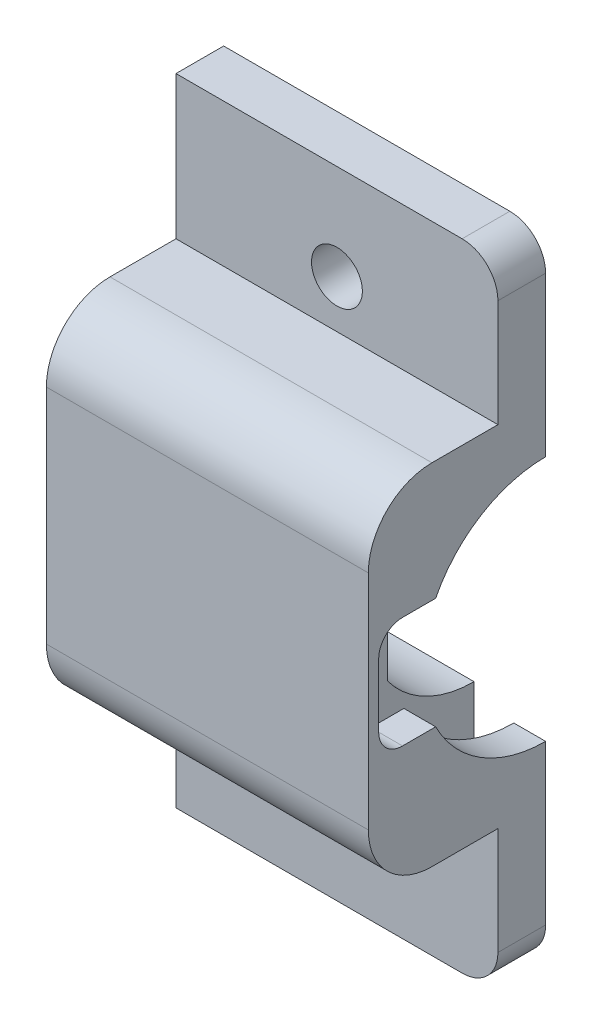
ISO-10303-21;
HEADER;
FILE_DESCRIPTION(('STEP AP214'),'2;1');
FILE_NAME('part.step','',(''),(''),'','','');
FILE_SCHEMA(('AUTOMOTIVE_DESIGN { 1 0 10303 214 1 1 1 1 }'));
ENDSEC;
DATA;
#1=APPLICATION_CONTEXT('core data for automotive mechanical design processes');
#2=APPLICATION_PROTOCOL_DEFINITION('international standard','automotive_design',2000,#1);
#3=PRODUCT_CONTEXT('',#1,'mechanical');
#4=PRODUCT('Part','Part','',(#3));
#5=PRODUCT_RELATED_PRODUCT_CATEGORY('part','',(#4));
#6=PRODUCT_DEFINITION_FORMATION('','',#4);
#7=PRODUCT_DEFINITION_CONTEXT('part definition',#1,'design');
#8=PRODUCT_DEFINITION('design','',#6,#7);
#9=PRODUCT_DEFINITION_SHAPE('','',#8);
#10=(LENGTH_UNIT() NAMED_UNIT(*) SI_UNIT(.MILLI.,.METRE.));
#11=(NAMED_UNIT(*) PLANE_ANGLE_UNIT() SI_UNIT($,.RADIAN.));
#12=(NAMED_UNIT(*) SI_UNIT($,.STERADIAN.) SOLID_ANGLE_UNIT());
#13=UNCERTAINTY_MEASURE_WITH_UNIT(LENGTH_MEASURE(1.E-05),#10,'distance_accuracy_value','');
#14=(GEOMETRIC_REPRESENTATION_CONTEXT(3) GLOBAL_UNCERTAINTY_ASSIGNED_CONTEXT((#13)) GLOBAL_UNIT_ASSIGNED_CONTEXT((#10,
#11,#12)) REPRESENTATION_CONTEXT('',''));
#15=CARTESIAN_POINT('',(0.,0.,0.));
#16=DIRECTION('',(0.,0.,1.));
#17=DIRECTION('',(1.,0.,0.));
#18=AXIS2_PLACEMENT_3D('',#15,#16,#17);
#19=CARTESIAN_POINT('',(1.75,0.,0.));
#20=DIRECTION('',(-1.,0.,0.));
#21=DIRECTION('',(0.,0.,1.));
#22=AXIS2_PLACEMENT_3D('',#19,#20,#21);
#23=PLANE('',#22);
#24=DIRECTION('',(0.,1.,0.));
#25=VECTOR('',#24,1.);
#26=CARTESIAN_POINT('',(1.75,23.982461550348,5.45));
#27=LINE('',#26,#25);
#28=CARTESIAN_POINT('',(1.75,16.017538449652,5.45));
#29=VERTEX_POINT('',#28);
#30=CARTESIAN_POINT('',(1.75,23.982461550348,5.45));
#31=VERTEX_POINT('',#30);
#32=EDGE_CURVE('E852',#29,#31,#27,.T.);
#33=ORIENTED_EDGE('',*,*,#32,.F.);
#34=CARTESIAN_POINT('',(1.75,20.,0.));
#35=DIRECTION('',(1.,0.,0.));
#36=DIRECTION('',(0.,0.,-1.));
#37=AXIS2_PLACEMENT_3D('',#34,#35,#36);
#38=CIRCLE('',#37,6.75);
#39=CARTESIAN_POINT('',(1.75,13.25,0.));
#40=VERTEX_POINT('',#39);
#41=EDGE_CURVE('E258',#29,#40,#38,.T.);
#42=ORIENTED_EDGE('',*,*,#41,.T.);
#43=DIRECTION('',(0.,1.,0.));
#44=VECTOR('',#43,1.);
#45=CARTESIAN_POINT('',(1.75,0.,0.));
#46=LINE('',#45,#44);
#47=CARTESIAN_POINT('',(1.75,26.75,0.));
#48=VERTEX_POINT('',#47);
#49=EDGE_CURVE('E406',#40,#48,#46,.T.);
#50=ORIENTED_EDGE('',*,*,#49,.T.);
#51=EDGE_CURVE('E267',#48,#31,#38,.T.);
#52=ORIENTED_EDGE('',*,*,#51,.T.);
#53=EDGE_LOOP('',(#33,#42,#50,#52));
#54=FACE_BOUND('',#53,.T.);
#55=ADVANCED_FACE('F35',(#54),#23,.F.);
#56=CARTESIAN_POINT('',(15.75,20.,0.));
#57=DIRECTION('',(1.,0.,0.));
#58=DIRECTION('',(0.,0.,-1.));
#59=AXIS2_PLACEMENT_3D('',#56,#57,#58);
#60=CYLINDRICAL_SURFACE('',#59,6.75);
#61=DIRECTION('',(-1.,0.,0.));
#62=VECTOR('',#61,1.);
#63=CARTESIAN_POINT('',(23.8203159789441,16.017538449652,5.45));
#64=LINE('',#63,#62);
#65=CARTESIAN_POINT('',(15.75,16.017538449652,5.45));
#66=VERTEX_POINT('',#65);
#67=EDGE_CURVE('E256',#66,#29,#64,.T.);
#68=ORIENTED_EDGE('',*,*,#67,.F.);
#69=CARTESIAN_POINT('',(15.75,20.,0.));
#70=DIRECTION('',(1.,0.,0.));
#71=DIRECTION('',(0.,0.,-1.));
#72=AXIS2_PLACEMENT_3D('',#69,#70,#71);
#73=CIRCLE('',#72,6.75);
#74=CARTESIAN_POINT('',(15.75,13.25,0.));
#75=VERTEX_POINT('',#74);
#76=EDGE_CURVE('E239',#66,#75,#73,.T.);
#77=ORIENTED_EDGE('',*,*,#76,.T.);
#78=DIRECTION('',(1.,0.,0.));
#79=VECTOR('',#78,1.);
#80=CARTESIAN_POINT('',(15.75,13.25,0.));
#81=LINE('',#80,#79);
#82=EDGE_CURVE('E270',#75,#40,#81,.F.);
#83=ORIENTED_EDGE('',*,*,#82,.T.);
#84=ORIENTED_EDGE('',*,*,#41,.F.);
#85=EDGE_LOOP('',(#68,#77,#83,#84));
#86=FACE_BOUND('',#85,.T.);
#87=ADVANCED_FACE('F257',(#86),#60,.F.);
#88=DIRECTION('',(-1.,0.,0.));
#89=VECTOR('',#88,1.);
#90=CARTESIAN_POINT('',(23.8203159789441,23.982461550348,5.45));
#91=LINE('',#90,#89);
#92=CARTESIAN_POINT('',(15.75,23.982461550348,5.45));
#93=VERTEX_POINT('',#92);
#94=EDGE_CURVE('E261',#93,#31,#91,.T.);
#95=ORIENTED_EDGE('',*,*,#94,.T.);
#96=ORIENTED_EDGE('',*,*,#51,.F.);
#97=DIRECTION('',(1.,0.,0.));
#98=VECTOR('',#97,1.);
#99=CARTESIAN_POINT('',(15.75,26.75,0.));
#100=LINE('',#99,#98);
#101=CARTESIAN_POINT('',(15.75,26.75,0.));
#102=VERTEX_POINT('',#101);
#103=EDGE_CURVE('E272',#48,#102,#100,.T.);
#104=ORIENTED_EDGE('',*,*,#103,.T.);
#105=EDGE_CURVE('E252',#102,#93,#73,.T.);
#106=ORIENTED_EDGE('',*,*,#105,.T.);
#107=EDGE_LOOP('',(#95,#96,#104,#106));
#108=FACE_BOUND('',#107,.T.);
#109=ADVANCED_FACE('F524',(#108),#60,.F.);
#110=CARTESIAN_POINT('',(20.25,20.,0.));
#111=DIRECTION('',(1.,0.,0.));
#112=DIRECTION('',(0.,0.,-1.));
#113=AXIS2_PLACEMENT_3D('',#110,#111,#112);
#114=CYLINDRICAL_SURFACE('',#113,7.75);
#115=CARTESIAN_POINT('',(20.25,20.,0.));
#116=DIRECTION('',(1.,0.,0.));
#117=DIRECTION('',(0.,0.,-1.));
#118=AXIS2_PLACEMENT_3D('',#115,#116,#117);
#119=CIRCLE('',#118,7.75);
#120=CARTESIAN_POINT('',(20.25,27.75,0.));
#121=VERTEX_POINT('',#120);
#122=CARTESIAN_POINT('',(20.25,23.5,6.91465834296966));
#123=VERTEX_POINT('',#122);
#124=EDGE_CURVE('E322',#121,#123,#119,.T.);
#125=ORIENTED_EDGE('',*,*,#124,.T.);
#126=DIRECTION('',(1.,0.,0.));
#127=VECTOR('',#126,1.);
#128=CARTESIAN_POINT('',(10.3852256995107,23.5,6.91465834296966));
#129=LINE('',#128,#127);
#130=CARTESIAN_POINT('',(18.25,23.5,6.91465834296966));
#131=VERTEX_POINT('',#130);
#132=EDGE_CURVE('E279',#131,#123,#129,.T.);
#133=ORIENTED_EDGE('',*,*,#132,.F.);
#134=CARTESIAN_POINT('',(18.25,20.,0.));
#135=DIRECTION('',(1.,0.,0.));
#136=DIRECTION('',(0.,0.,-1.));
#137=AXIS2_PLACEMENT_3D('',#134,#135,#136);
#138=CIRCLE('',#137,7.75);
#139=CARTESIAN_POINT('',(18.25,27.75,0.));
#140=VERTEX_POINT('',#139);
#141=EDGE_CURVE('E326',#140,#131,#138,.T.);
#142=ORIENTED_EDGE('',*,*,#141,.F.);
#143=DIRECTION('',(1.,0.,0.));
#144=VECTOR('',#143,1.);
#145=CARTESIAN_POINT('',(20.25,27.75,0.));
#146=LINE('',#145,#144);
#147=EDGE_CURVE('E380',#140,#121,#146,.T.);
#148=ORIENTED_EDGE('',*,*,#147,.T.);
#149=EDGE_LOOP('',(#125,#133,#142,#148));
#150=FACE_BOUND('',#149,.T.);
#151=ADVANCED_FACE('F568',(#150),#114,.F.);
#152=CARTESIAN_POINT('',(18.25,30.25,31.8018764280634));
#153=DIRECTION('',(1.,0.,0.));
#154=DIRECTION('',(0.,1.,0.));
#155=AXIS2_PLACEMENT_3D('',#152,#153,#154);
#156=PLANE('',#155);
#157=DIRECTION('',(0.,-1.,0.));
#158=VECTOR('',#157,1.);
#159=CARTESIAN_POINT('',(18.25,30.25,10.4));
#160=LINE('',#159,#158);
#161=CARTESIAN_POINT('',(18.25,27.25,10.4));
#162=VERTEX_POINT('',#161);
#163=CARTESIAN_POINT('',(18.25,22.5385164807135,10.4));
#164=VERTEX_POINT('',#163);
#165=EDGE_CURVE('E307',#162,#164,#160,.T.);
#166=ORIENTED_EDGE('',*,*,#165,.F.);
#167=CARTESIAN_POINT('',(18.25,27.25,7.4));
#168=DIRECTION('',(1.,0.,0.));
#169=DIRECTION('',(0.,1.,0.));
#170=AXIS2_PLACEMENT_3D('',#167,#168,#169);
#171=CIRCLE('',#170,3.);
#172=CARTESIAN_POINT('',(18.25,30.25,7.4));
#173=VERTEX_POINT('',#172);
#174=EDGE_CURVE('E422',#162,#173,#171,.F.);
#175=ORIENTED_EDGE('',*,*,#174,.T.);
#176=DIRECTION('',(0.,0.,-1.));
#177=VECTOR('',#176,1.);
#178=CARTESIAN_POINT('',(18.25,30.25,31.8018764280634));
#179=LINE('',#178,#177);
#180=CARTESIAN_POINT('',(18.25,30.25,0.));
#181=VERTEX_POINT('',#180);
#182=EDGE_CURVE('E316',#173,#181,#179,.T.);
#183=ORIENTED_EDGE('',*,*,#182,.T.);
#184=DIRECTION('',(0.,-1.,0.));
#185=VECTOR('',#184,1.);
#186=CARTESIAN_POINT('',(18.25,30.25,0.));
#187=LINE('',#186,#185);
#188=EDGE_CURVE('E305',#181,#140,#187,.T.);
#189=ORIENTED_EDGE('',*,*,#188,.T.);
#190=ORIENTED_EDGE('',*,*,#141,.T.);
#191=DIRECTION('',(0.,0.,-1.));
#192=VECTOR('',#191,1.);
#193=CARTESIAN_POINT('',(18.25,23.5,10.5));
#194=LINE('',#193,#192);
#195=CARTESIAN_POINT('',(18.25,23.5,9.));
#196=VERTEX_POINT('',#195);
#197=EDGE_CURVE('E278',#196,#131,#194,.T.);
#198=ORIENTED_EDGE('',*,*,#197,.F.);
#199=CARTESIAN_POINT('',(18.25,22.,9.));
#200=DIRECTION('',(1.,0.,0.));
#201=DIRECTION('',(0.,1.,0.));
#202=AXIS2_PLACEMENT_3D('',#199,#200,#201);
#203=CIRCLE('',#202,1.5);
#204=EDGE_CURVE('E403',#196,#164,#203,.T.);
#205=ORIENTED_EDGE('',*,*,#204,.T.);
#206=EDGE_LOOP('',(#166,#175,#183,#189,#190,#198,#205));
#207=FACE_BOUND('',#206,.T.);
#208=ADVANCED_FACE('F552',(#207),#156,.F.);
#209=CARTESIAN_POINT('',(0.,0.,3.));
#210=DIRECTION('',(0.,0.,-1.));
#211=DIRECTION('',(-1.,0.,0.));
#212=AXIS2_PLACEMENT_3D('',#209,#210,#211);
#213=PLANE('',#212);
#214=CARTESIAN_POINT('',(10.125,34.,3.));
#215=DIRECTION('',(0.,0.,1.));
#216=DIRECTION('',(1.,0.,0.));
#217=AXIS2_PLACEMENT_3D('',#214,#215,#216);
#218=CIRCLE('',#217,1.6);
#219=CARTESIAN_POINT('',(11.725,34.,3.));
#220=VERTEX_POINT('',#219);
#221=EDGE_CURVE('E846',#220,#220,#218,.T.);
#222=ORIENTED_EDGE('',*,*,#221,.F.);
#223=EDGE_LOOP('',(#222));
#224=FACE_BOUND('',#223,.T.);
#225=DIRECTION('',(0.,1.,0.));
#226=VECTOR('',#225,1.);
#227=CARTESIAN_POINT('',(20.25,0.,3.));
#228=LINE('',#227,#226);
#229=CARTESIAN_POINT('',(20.25,31.,3.));
#230=VERTEX_POINT('',#229);
#231=CARTESIAN_POINT('',(20.25,37.75,3.));
#232=VERTEX_POINT('',#231);
#233=EDGE_CURVE('E357',#230,#232,#228,.T.);
#234=ORIENTED_EDGE('',*,*,#233,.T.);
#235=CARTESIAN_POINT('',(18.,37.75,3.));
#236=DIRECTION('',(0.,0.,-1.));
#237=DIRECTION('',(-1.,0.,0.));
#238=AXIS2_PLACEMENT_3D('',#235,#236,#237);
#239=CIRCLE('',#238,2.25);
#240=CARTESIAN_POINT('',(18.,40.,3.));
#241=VERTEX_POINT('',#240);
#242=EDGE_CURVE('E12',#232,#241,#239,.F.);
#243=ORIENTED_EDGE('',*,*,#242,.T.);
#244=DIRECTION('',(-1.,0.,0.));
#245=VECTOR('',#244,1.);
#246=CARTESIAN_POINT('',(0.,40.,3.));
#247=LINE('',#246,#245);
#248=CARTESIAN_POINT('',(0.,40.,3.));
#249=VERTEX_POINT('',#248);
#250=EDGE_CURVE('E360',#241,#249,#247,.T.);
#251=ORIENTED_EDGE('',*,*,#250,.T.);
#252=DIRECTION('',(0.,-1.,0.));
#253=VECTOR('',#252,1.);
#254=CARTESIAN_POINT('',(0.,0.,3.));
#255=LINE('',#254,#253);
#256=CARTESIAN_POINT('',(0.,31.,3.));
#257=VERTEX_POINT('',#256);
#258=EDGE_CURVE('E351',#249,#257,#255,.T.);
#259=ORIENTED_EDGE('',*,*,#258,.T.);
#260=DIRECTION('',(-1.,0.,0.));
#261=VECTOR('',#260,1.);
#262=CARTESIAN_POINT('',(0.,31.,3.));
#263=LINE('',#262,#261);
#264=EDGE_CURVE('E334',#230,#257,#263,.T.);
#265=ORIENTED_EDGE('',*,*,#264,.F.);
#266=EDGE_LOOP('',(#234,#243,#251,#259,#265));
#267=FACE_BOUND('',#266,.T.);
#268=ADVANCED_FACE('F476',(#224,#267),#213,.F.);
#269=CARTESIAN_POINT('',(10.125,6.,3.));
#270=DIRECTION('',(0.,0.,1.));
#271=DIRECTION('',(1.,0.,0.));
#272=AXIS2_PLACEMENT_3D('',#269,#270,#271);
#273=CIRCLE('',#272,1.6);
#274=CARTESIAN_POINT('',(11.725,6.,3.));
#275=VERTEX_POINT('',#274);
#276=EDGE_CURVE('E841',#275,#275,#273,.T.);
#277=ORIENTED_EDGE('',*,*,#276,.F.);
#278=EDGE_LOOP('',(#277));
#279=FACE_BOUND('',#278,.T.);
#280=DIRECTION('',(1.,0.,0.));
#281=VECTOR('',#280,1.);
#282=CARTESIAN_POINT('',(0.,0.,3.));
#283=LINE('',#282,#281);
#284=CARTESIAN_POINT('',(0.,0.,3.));
#285=VERTEX_POINT('',#284);
#286=CARTESIAN_POINT('',(18.,0.,3.));
#287=VERTEX_POINT('',#286);
#288=EDGE_CURVE('E354',#285,#287,#283,.T.);
#289=ORIENTED_EDGE('',*,*,#288,.T.);
#290=CARTESIAN_POINT('',(18.,2.25,3.));
#291=DIRECTION('',(0.,0.,-1.));
#292=DIRECTION('',(-1.,0.,0.));
#293=AXIS2_PLACEMENT_3D('',#290,#291,#292);
#294=CIRCLE('',#293,2.25);
#295=CARTESIAN_POINT('',(20.25,2.25,3.));
#296=VERTEX_POINT('',#295);
#297=EDGE_CURVE('E454',#287,#296,#294,.F.);
#298=ORIENTED_EDGE('',*,*,#297,.T.);
#299=CARTESIAN_POINT('',(20.25,9.00000000000001,3.));
#300=VERTEX_POINT('',#299);
#301=EDGE_CURVE('E358',#296,#300,#228,.T.);
#302=ORIENTED_EDGE('',*,*,#301,.T.);
#303=DIRECTION('',(1.,0.,0.));
#304=VECTOR('',#303,1.);
#305=CARTESIAN_POINT('',(0.,9.00000000000001,3.));
#306=LINE('',#305,#304);
#307=CARTESIAN_POINT('',(0.,9.00000000000001,3.));
#308=VERTEX_POINT('',#307);
#309=EDGE_CURVE('E329',#308,#300,#306,.T.);
#310=ORIENTED_EDGE('',*,*,#309,.F.);
#311=EDGE_CURVE('E355',#308,#285,#255,.T.);
#312=ORIENTED_EDGE('',*,*,#311,.T.);
#313=EDGE_LOOP('',(#289,#298,#302,#310,#312));
#314=FACE_BOUND('',#313,.T.);
#315=ADVANCED_FACE('F503',(#279,#314),#213,.F.);
#316=CARTESIAN_POINT('',(0.,0.,3.));
#317=DIRECTION('',(1.,0.,0.));
#318=DIRECTION('',(0.,1.,0.));
#319=AXIS2_PLACEMENT_3D('',#316,#317,#318);
#320=PLANE('',#319);
#321=DIRECTION('',(0.,0.,-1.));
#322=VECTOR('',#321,1.);
#323=CARTESIAN_POINT('',(0.,9.00000000000001,11.15));
#324=LINE('',#323,#322);
#325=CARTESIAN_POINT('',(0.,9.00000000000001,7.15));
#326=VERTEX_POINT('',#325);
#327=EDGE_CURVE('E348',#326,#308,#324,.T.);
#328=ORIENTED_EDGE('',*,*,#327,.F.);
#329=CARTESIAN_POINT('',(0.,13.,7.15));
#330=DIRECTION('',(1.,0.,0.));
#331=DIRECTION('',(0.,1.,0.));
#332=AXIS2_PLACEMENT_3D('',#329,#330,#331);
#333=CIRCLE('',#332,4.);
#334=CARTESIAN_POINT('',(0.,13.,11.15));
#335=VERTEX_POINT('',#334);
#336=EDGE_CURVE('E440',#326,#335,#333,.F.);
#337=ORIENTED_EDGE('',*,*,#336,.T.);
#338=DIRECTION('',(0.,-1.,0.));
#339=VECTOR('',#338,1.);
#340=CARTESIAN_POINT('',(0.,31.,11.15));
#341=LINE('',#340,#339);
#342=CARTESIAN_POINT('',(0.,27.,11.15));
#343=VERTEX_POINT('',#342);
#344=EDGE_CURVE('E330',#343,#335,#341,.T.);
#345=ORIENTED_EDGE('',*,*,#344,.F.);
#346=CARTESIAN_POINT('',(0.,27.,7.15));
#347=DIRECTION('',(1.,0.,0.));
#348=DIRECTION('',(0.,1.,0.));
#349=AXIS2_PLACEMENT_3D('',#346,#347,#348);
#350=CIRCLE('',#349,4.);
#351=CARTESIAN_POINT('',(0.,31.,7.15));
#352=VERTEX_POINT('',#351);
#353=EDGE_CURVE('E438',#343,#352,#350,.F.);
#354=ORIENTED_EDGE('',*,*,#353,.T.);
#355=DIRECTION('',(0.,0.,-1.));
#356=VECTOR('',#355,1.);
#357=CARTESIAN_POINT('',(0.,31.,11.15));
#358=LINE('',#357,#356);
#359=EDGE_CURVE('E337',#352,#257,#358,.T.);
#360=ORIENTED_EDGE('',*,*,#359,.T.);
#361=ORIENTED_EDGE('',*,*,#258,.F.);
#362=DIRECTION('',(0.,0.,-1.));
#363=VECTOR('',#362,1.);
#364=CARTESIAN_POINT('',(0.,40.,3.));
#365=LINE('',#364,#363);
#366=CARTESIAN_POINT('',(0.,40.,0.));
#367=VERTEX_POINT('',#366);
#368=EDGE_CURVE('E362',#249,#367,#365,.T.);
#369=ORIENTED_EDGE('',*,*,#368,.T.);
#370=DIRECTION('',(0.,-1.,0.));
#371=VECTOR('',#370,1.);
#372=CARTESIAN_POINT('',(0.,0.,0.));
#373=LINE('',#372,#371);
#374=CARTESIAN_POINT('',(0.,0.,0.));
#375=VERTEX_POINT('',#374);
#376=EDGE_CURVE('E350',#367,#375,#373,.T.);
#377=ORIENTED_EDGE('',*,*,#376,.T.);
#378=DIRECTION('',(0.,0.,-1.));
#379=VECTOR('',#378,1.);
#380=CARTESIAN_POINT('',(0.,0.,3.));
#381=LINE('',#380,#379);
#382=EDGE_CURVE('E374',#285,#375,#381,.T.);
#383=ORIENTED_EDGE('',*,*,#382,.F.);
#384=ORIENTED_EDGE('',*,*,#311,.F.);
#385=EDGE_LOOP('',(#328,#337,#345,#354,#360,#361,#369,#377,#383,#384));
#386=FACE_BOUND('',#385,.T.);
#387=ADVANCED_FACE('F471',(#386),#320,.F.);
#388=CARTESIAN_POINT('',(0.,0.,3.));
#389=DIRECTION('',(0.,1.,0.));
#390=DIRECTION('',(0.,0.,1.));
#391=AXIS2_PLACEMENT_3D('',#388,#389,#390);
#392=PLANE('',#391);
#393=DIRECTION('',(1.,0.,0.));
#394=VECTOR('',#393,1.);
#395=CARTESIAN_POINT('',(0.,0.,0.));
#396=LINE('',#395,#394);
#397=CARTESIAN_POINT('',(18.,0.,0.));
#398=VERTEX_POINT('',#397);
#399=EDGE_CURVE('E365',#375,#398,#396,.T.);
#400=ORIENTED_EDGE('',*,*,#399,.T.);
#401=DIRECTION('',(0.,0.,-1.));
#402=VECTOR('',#401,1.);
#403=CARTESIAN_POINT('',(18.,0.,3.));
#404=LINE('',#403,#402);
#405=EDGE_CURVE('E56',#398,#287,#404,.F.);
#406=ORIENTED_EDGE('',*,*,#405,.T.);
#407=ORIENTED_EDGE('',*,*,#288,.F.);
#408=ORIENTED_EDGE('',*,*,#382,.T.);
#409=EDGE_LOOP('',(#400,#406,#407,#408));
#410=FACE_BOUND('',#409,.T.);
#411=ADVANCED_FACE('F509',(#410),#392,.F.);
#412=CARTESIAN_POINT('',(20.25,0.,3.));
#413=DIRECTION('',(-1.,0.,0.));
#414=DIRECTION('',(0.,-1.,0.));
#415=AXIS2_PLACEMENT_3D('',#412,#413,#414);
#416=PLANE('',#415);
#417=ORIENTED_EDGE('',*,*,#301,.F.);
#418=DIRECTION('',(0.,0.,-1.));
#419=VECTOR('',#418,1.);
#420=CARTESIAN_POINT('',(20.25,2.25,3.));
#421=LINE('',#420,#419);
#422=CARTESIAN_POINT('',(20.25,2.25,0.));
#423=VERTEX_POINT('',#422);
#424=EDGE_CURVE('E446',#296,#423,#421,.T.);
#425=ORIENTED_EDGE('',*,*,#424,.T.);
#426=DIRECTION('',(0.,1.,0.));
#427=VECTOR('',#426,1.);
#428=CARTESIAN_POINT('',(20.25,0.,0.));
#429=LINE('',#428,#427);
#430=CARTESIAN_POINT('',(20.25,12.25,0.));
#431=VERTEX_POINT('',#430);
#432=EDGE_CURVE('E368',#423,#431,#429,.T.);
#433=ORIENTED_EDGE('',*,*,#432,.T.);
#434=CARTESIAN_POINT('',(20.25,16.5,6.91465834296966));
#435=VERTEX_POINT('',#434);
#436=EDGE_CURVE('E321',#435,#431,#119,.T.);
#437=ORIENTED_EDGE('',*,*,#436,.F.);
#438=DIRECTION('',(0.,0.,-1.));
#439=VECTOR('',#438,1.);
#440=CARTESIAN_POINT('',(20.25,16.5,10.5));
#441=LINE('',#440,#439);
#442=CARTESIAN_POINT('',(20.25,16.5,9.));
#443=VERTEX_POINT('',#442);
#444=EDGE_CURVE('E287',#443,#435,#441,.T.);
#445=ORIENTED_EDGE('',*,*,#444,.F.);
#446=CARTESIAN_POINT('',(20.25,18.,9.));
#447=DIRECTION('',(-1.,0.,0.));
#448=DIRECTION('',(0.,-1.,0.));
#449=AXIS2_PLACEMENT_3D('',#446,#447,#448);
#450=CIRCLE('',#449,1.5);
#451=CARTESIAN_POINT('',(20.25,18.,10.5));
#452=VERTEX_POINT('',#451);
#453=EDGE_CURVE('E397',#443,#452,#450,.T.);
#454=ORIENTED_EDGE('',*,*,#453,.T.);
#455=DIRECTION('',(0.,-1.,0.));
#456=VECTOR('',#455,1.);
#457=CARTESIAN_POINT('',(20.25,16.5,10.5));
#458=LINE('',#457,#456);
#459=CARTESIAN_POINT('',(20.25,22.,10.5));
#460=VERTEX_POINT('',#459);
#461=EDGE_CURVE('E284',#460,#452,#458,.T.);
#462=ORIENTED_EDGE('',*,*,#461,.F.);
#463=CARTESIAN_POINT('',(20.25,22.,9.));
#464=DIRECTION('',(-1.,0.,0.));
#465=DIRECTION('',(0.,-1.,0.));
#466=AXIS2_PLACEMENT_3D('',#463,#464,#465);
#467=CIRCLE('',#466,1.5);
#468=CARTESIAN_POINT('',(20.25,23.5,9.));
#469=VERTEX_POINT('',#468);
#470=EDGE_CURVE('E401',#460,#469,#467,.T.);
#471=ORIENTED_EDGE('',*,*,#470,.T.);
#472=DIRECTION('',(0.,0.,1.));
#473=VECTOR('',#472,1.);
#474=CARTESIAN_POINT('',(20.25,23.5,10.5));
#475=LINE('',#474,#473);
#476=EDGE_CURVE('E274',#123,#469,#475,.T.);
#477=ORIENTED_EDGE('',*,*,#476,.F.);
#478=ORIENTED_EDGE('',*,*,#124,.F.);
#479=CARTESIAN_POINT('',(20.25,37.75,0.));
#480=VERTEX_POINT('',#479);
#481=EDGE_CURVE('E367',#121,#480,#429,.T.);
#482=ORIENTED_EDGE('',*,*,#481,.T.);
#483=DIRECTION('',(0.,0.,-1.));
#484=VECTOR('',#483,1.);
#485=CARTESIAN_POINT('',(20.25,37.75,3.));
#486=LINE('',#485,#484);
#487=EDGE_CURVE('E444',#480,#232,#486,.F.);
#488=ORIENTED_EDGE('',*,*,#487,.T.);
#489=ORIENTED_EDGE('',*,*,#233,.F.);
#490=DIRECTION('',(0.,0.,-1.));
#491=VECTOR('',#490,1.);
#492=CARTESIAN_POINT('',(20.25,31.,11.15));
#493=LINE('',#492,#491);
#494=CARTESIAN_POINT('',(20.25,31.,7.15));
#495=VERTEX_POINT('',#494);
#496=EDGE_CURVE('E343',#495,#230,#493,.T.);
#497=ORIENTED_EDGE('',*,*,#496,.F.);
#498=CARTESIAN_POINT('',(20.25,27.,7.15));
#499=DIRECTION('',(-1.,0.,0.));
#500=DIRECTION('',(0.,-1.,0.));
#501=AXIS2_PLACEMENT_3D('',#498,#499,#500);
#502=CIRCLE('',#501,4.);
#503=CARTESIAN_POINT('',(20.25,27.,11.15));
#504=VERTEX_POINT('',#503);
#505=EDGE_CURVE('E432',#495,#504,#502,.F.);
#506=ORIENTED_EDGE('',*,*,#505,.T.);
#507=DIRECTION('',(0.,1.,0.));
#508=VECTOR('',#507,1.);
#509=CARTESIAN_POINT('',(20.25,31.,11.15));
#510=LINE('',#509,#508);
#511=CARTESIAN_POINT('',(20.25,13.,11.15));
#512=VERTEX_POINT('',#511);
#513=EDGE_CURVE('E333',#512,#504,#510,.T.);
#514=ORIENTED_EDGE('',*,*,#513,.F.);
#515=CARTESIAN_POINT('',(20.25,13.,7.15));
#516=DIRECTION('',(-1.,0.,0.));
#517=DIRECTION('',(0.,-1.,0.));
#518=AXIS2_PLACEMENT_3D('',#515,#516,#517);
#519=CIRCLE('',#518,4.);
#520=CARTESIAN_POINT('',(20.25,9.00000000000001,7.15));
#521=VERTEX_POINT('',#520);
#522=EDGE_CURVE('E434',#512,#521,#519,.F.);
#523=ORIENTED_EDGE('',*,*,#522,.T.);
#524=DIRECTION('',(0.,0.,-1.));
#525=VECTOR('',#524,1.);
#526=CARTESIAN_POINT('',(20.25,9.00000000000001,11.15));
#527=LINE('',#526,#525);
#528=EDGE_CURVE('E345',#521,#300,#527,.T.);
#529=ORIENTED_EDGE('',*,*,#528,.T.);
#530=EDGE_LOOP('',(#417,#425,#433,#437,#445,#454,#462,#471,#477,#478,#482,#488,#489,#497,#506,
#514,#523,#529));
#531=FACE_BOUND('',#530,.T.);
#532=ADVANCED_FACE('F485',(#531),#416,.F.);
#533=CARTESIAN_POINT('',(0.,40.,3.));
#534=DIRECTION('',(0.,-1.,0.));
#535=DIRECTION('',(0.,0.,-1.));
#536=AXIS2_PLACEMENT_3D('',#533,#534,#535);
#537=PLANE('',#536);
#538=ORIENTED_EDGE('',*,*,#250,.F.);
#539=DIRECTION('',(0.,0.,-1.));
#540=VECTOR('',#539,1.);
#541=CARTESIAN_POINT('',(18.,40.,3.));
#542=LINE('',#541,#540);
#543=CARTESIAN_POINT('',(18.,40.,0.));
#544=VERTEX_POINT('',#543);
#545=EDGE_CURVE('E43',#241,#544,#542,.T.);
#546=ORIENTED_EDGE('',*,*,#545,.T.);
#547=DIRECTION('',(-1.,0.,0.));
#548=VECTOR('',#547,1.);
#549=CARTESIAN_POINT('',(0.,40.,0.));
#550=LINE('',#549,#548);
#551=EDGE_CURVE('E370',#544,#367,#550,.T.);
#552=ORIENTED_EDGE('',*,*,#551,.T.);
#553=ORIENTED_EDGE('',*,*,#368,.F.);
#554=EDGE_LOOP('',(#538,#546,#552,#553));
#555=FACE_BOUND('',#554,.T.);
#556=ADVANCED_FACE('F459',(#555),#537,.F.);
#557=CARTESIAN_POINT('',(0.,0.,0.));
#558=DIRECTION('',(0.,0.,-1.));
#559=DIRECTION('',(-1.,0.,0.));
#560=AXIS2_PLACEMENT_3D('',#557,#558,#559);
#561=PLANE('',#560);
#562=CARTESIAN_POINT('',(10.125,6.,0.));
#563=DIRECTION('',(0.,0.,1.));
#564=DIRECTION('',(1.,0.,0.));
#565=AXIS2_PLACEMENT_3D('',#562,#563,#564);
#566=CIRCLE('',#565,1.6);
#567=CARTESIAN_POINT('',(11.725,6.,0.));
#568=VERTEX_POINT('',#567);
#569=EDGE_CURVE('E843',#568,#568,#566,.T.);
#570=ORIENTED_EDGE('',*,*,#569,.T.);
#571=EDGE_LOOP('',(#570));
#572=FACE_BOUND('',#571,.T.);
#573=CARTESIAN_POINT('',(10.125,34.,0.));
#574=DIRECTION('',(0.,0.,1.));
#575=DIRECTION('',(1.,0.,0.));
#576=AXIS2_PLACEMENT_3D('',#573,#574,#575);
#577=CIRCLE('',#576,1.6);
#578=CARTESIAN_POINT('',(11.725,34.,0.));
#579=VERTEX_POINT('',#578);
#580=EDGE_CURVE('E849',#579,#579,#577,.T.);
#581=ORIENTED_EDGE('',*,*,#580,.T.);
#582=EDGE_LOOP('',(#581));
#583=FACE_BOUND('',#582,.T.);
#584=ORIENTED_EDGE('',*,*,#432,.F.);
#585=CARTESIAN_POINT('',(18.,2.25,0.));
#586=DIRECTION('',(0.,0.,-1.));
#587=DIRECTION('',(-1.,0.,0.));
#588=AXIS2_PLACEMENT_3D('',#585,#586,#587);
#589=CIRCLE('',#588,2.25);
#590=EDGE_CURVE('E451',#423,#398,#589,.T.);
#591=ORIENTED_EDGE('',*,*,#590,.T.);
#592=ORIENTED_EDGE('',*,*,#399,.F.);
#593=ORIENTED_EDGE('',*,*,#376,.F.);
#594=ORIENTED_EDGE('',*,*,#551,.F.);
#595=CARTESIAN_POINT('',(18.,37.75,0.));
#596=DIRECTION('',(0.,0.,-1.));
#597=DIRECTION('',(-1.,0.,0.));
#598=AXIS2_PLACEMENT_3D('',#595,#596,#597);
#599=CIRCLE('',#598,2.25);
#600=EDGE_CURVE('E449',#544,#480,#599,.T.);
#601=ORIENTED_EDGE('',*,*,#600,.T.);
#602=ORIENTED_EDGE('',*,*,#481,.F.);
#603=ORIENTED_EDGE('',*,*,#147,.F.);
#604=ORIENTED_EDGE('',*,*,#188,.F.);
#605=DIRECTION('',(1.,0.,0.));
#606=VECTOR('',#605,1.);
#607=CARTESIAN_POINT('',(18.25,30.25,0.));
#608=LINE('',#607,#606);
#609=CARTESIAN_POINT('',(15.75,30.25,0.));
#610=VERTEX_POINT('',#609);
#611=EDGE_CURVE('E296',#610,#181,#608,.T.);
#612=ORIENTED_EDGE('',*,*,#611,.F.);
#613=DIRECTION('',(0.,1.,0.));
#614=VECTOR('',#613,1.);
#615=CARTESIAN_POINT('',(15.75,30.25,0.));
#616=LINE('',#615,#614);
#617=EDGE_CURVE('E301',#102,#610,#616,.T.);
#618=ORIENTED_EDGE('',*,*,#617,.F.);
#619=ORIENTED_EDGE('',*,*,#103,.F.);
#620=ORIENTED_EDGE('',*,*,#49,.F.);
#621=ORIENTED_EDGE('',*,*,#82,.F.);
#622=CARTESIAN_POINT('',(15.75,9.75,0.));
#623=VERTEX_POINT('',#622);
#624=EDGE_CURVE('E248',#623,#75,#616,.T.);
#625=ORIENTED_EDGE('',*,*,#624,.F.);
#626=DIRECTION('',(-1.,0.,0.));
#627=VECTOR('',#626,1.);
#628=CARTESIAN_POINT('',(18.25,9.75,0.));
#629=LINE('',#628,#627);
#630=CARTESIAN_POINT('',(18.25,9.75,0.));
#631=VERTEX_POINT('',#630);
#632=EDGE_CURVE('E302',#631,#623,#629,.T.);
#633=ORIENTED_EDGE('',*,*,#632,.F.);
#634=CARTESIAN_POINT('',(18.25,12.25,0.));
#635=VERTEX_POINT('',#634);
#636=EDGE_CURVE('E295',#635,#631,#187,.T.);
#637=ORIENTED_EDGE('',*,*,#636,.F.);
#638=DIRECTION('',(1.,0.,0.));
#639=VECTOR('',#638,1.);
#640=CARTESIAN_POINT('',(20.25,12.25,0.));
#641=LINE('',#640,#639);
#642=EDGE_CURVE('E377',#431,#635,#641,.F.);
#643=ORIENTED_EDGE('',*,*,#642,.F.);
#644=EDGE_LOOP('',(#584,#591,#592,#593,#594,#601,#602,#603,#604,#612,#618,#619,#620,#621,#625,
#633,#637,#643));
#645=FACE_BOUND('',#644,.T.);
#646=ADVANCED_FACE('F465',(#572,#583,#645),#561,.T.);
#647=CARTESIAN_POINT('',(0.,9.00000000000001,11.15));
#648=DIRECTION('',(0.,1.,0.));
#649=DIRECTION('',(0.,0.,1.));
#650=AXIS2_PLACEMENT_3D('',#647,#648,#649);
#651=PLANE('',#650);
#652=ORIENTED_EDGE('',*,*,#528,.F.);
#653=DIRECTION('',(1.,0.,0.));
#654=VECTOR('',#653,1.);
#655=CARTESIAN_POINT('',(0.,9.00000000000001,7.15));
#656=LINE('',#655,#654);
#657=EDGE_CURVE('E436',#521,#326,#656,.F.);
#658=ORIENTED_EDGE('',*,*,#657,.T.);
#659=ORIENTED_EDGE('',*,*,#327,.T.);
#660=ORIENTED_EDGE('',*,*,#309,.T.);
#661=EDGE_LOOP('',(#652,#658,#659,#660));
#662=FACE_BOUND('',#661,.T.);
#663=ADVANCED_FACE('F500',(#662),#651,.F.);
#664=CARTESIAN_POINT('',(0.,31.,11.15));
#665=DIRECTION('',(0.,-1.,0.));
#666=DIRECTION('',(1.,0.,0.));
#667=AXIS2_PLACEMENT_3D('',#664,#665,#666);
#668=PLANE('',#667);
#669=ORIENTED_EDGE('',*,*,#359,.F.);
#670=DIRECTION('',(-1.,0.,0.));
#671=VECTOR('',#670,1.);
#672=CARTESIAN_POINT('',(20.25,31.,7.15));
#673=LINE('',#672,#671);
#674=EDGE_CURVE('E442',#352,#495,#673,.F.);
#675=ORIENTED_EDGE('',*,*,#674,.T.);
#676=ORIENTED_EDGE('',*,*,#496,.T.);
#677=ORIENTED_EDGE('',*,*,#264,.T.);
#678=EDGE_LOOP('',(#669,#675,#676,#677));
#679=FACE_BOUND('',#678,.T.);
#680=ADVANCED_FACE('F479',(#679),#668,.F.);
#681=CARTESIAN_POINT('',(0.,0.,11.15));
#682=DIRECTION('',(0.,0.,1.));
#683=DIRECTION('',(1.,0.,0.));
#684=AXIS2_PLACEMENT_3D('',#681,#682,#683);
#685=PLANE('',#684);
#686=ORIENTED_EDGE('',*,*,#344,.T.);
#687=DIRECTION('',(1.,0.,0.));
#688=VECTOR('',#687,1.);
#689=CARTESIAN_POINT('',(20.25,13.,11.15));
#690=LINE('',#689,#688);
#691=EDGE_CURVE('E429',#335,#512,#690,.T.);
#692=ORIENTED_EDGE('',*,*,#691,.T.);
#693=ORIENTED_EDGE('',*,*,#513,.T.);
#694=DIRECTION('',(-1.,0.,0.));
#695=VECTOR('',#694,1.);
#696=CARTESIAN_POINT('',(0.,27.,11.15));
#697=LINE('',#696,#695);
#698=EDGE_CURVE('E426',#504,#343,#697,.T.);
#699=ORIENTED_EDGE('',*,*,#698,.T.);
#700=EDGE_LOOP('',(#686,#692,#693,#699));
#701=FACE_BOUND('',#700,.T.);
#702=ADVANCED_FACE('F492',(#701),#685,.T.);
#703=CARTESIAN_POINT('',(18.25,16.5,6.91465834296967));
#704=VERTEX_POINT('',#703);
#705=EDGE_CURVE('E325',#704,#635,#138,.T.);
#706=ORIENTED_EDGE('',*,*,#705,.F.);
#707=DIRECTION('',(1.,0.,0.));
#708=VECTOR('',#707,1.);
#709=CARTESIAN_POINT('',(10.3852256995107,16.5,6.91465834296966));
#710=LINE('',#709,#708);
#711=EDGE_CURVE('E289',#704,#435,#710,.T.);
#712=ORIENTED_EDGE('',*,*,#711,.T.);
#713=ORIENTED_EDGE('',*,*,#436,.T.);
#714=ORIENTED_EDGE('',*,*,#642,.T.);
#715=EDGE_LOOP('',(#706,#712,#713,#714));
#716=FACE_BOUND('',#715,.T.);
#717=ADVANCED_FACE('F550',(#716),#114,.F.);
#718=DIRECTION('',(0.,0.,-1.));
#719=VECTOR('',#718,1.);
#720=CARTESIAN_POINT('',(18.25,9.75,31.8018764280634));
#721=LINE('',#720,#719);
#722=CARTESIAN_POINT('',(18.25,9.75,7.4));
#723=VERTEX_POINT('',#722);
#724=EDGE_CURVE('E309',#723,#631,#721,.T.);
#725=ORIENTED_EDGE('',*,*,#724,.F.);
#726=CARTESIAN_POINT('',(18.25,12.75,7.4));
#727=DIRECTION('',(1.,0.,0.));
#728=DIRECTION('',(0.,1.,0.));
#729=AXIS2_PLACEMENT_3D('',#726,#727,#728);
#730=CIRCLE('',#729,3.);
#731=CARTESIAN_POINT('',(18.25,12.75,10.4));
#732=VERTEX_POINT('',#731);
#733=EDGE_CURVE('E420',#723,#732,#730,.F.);
#734=ORIENTED_EDGE('',*,*,#733,.T.);
#735=CARTESIAN_POINT('',(18.25,17.4614835192866,10.4));
#736=VERTEX_POINT('',#735);
#737=EDGE_CURVE('E311',#736,#732,#160,.T.);
#738=ORIENTED_EDGE('',*,*,#737,.F.);
#739=CARTESIAN_POINT('',(18.25,18.,9.));
#740=DIRECTION('',(1.,0.,0.));
#741=DIRECTION('',(0.,1.,0.));
#742=AXIS2_PLACEMENT_3D('',#739,#740,#741);
#743=CIRCLE('',#742,1.5);
#744=CARTESIAN_POINT('',(18.25,16.5,9.));
#745=VERTEX_POINT('',#744);
#746=EDGE_CURVE('E399',#736,#745,#743,.T.);
#747=ORIENTED_EDGE('',*,*,#746,.T.);
#748=DIRECTION('',(0.,0.,1.));
#749=VECTOR('',#748,1.);
#750=CARTESIAN_POINT('',(18.25,16.5,10.5));
#751=LINE('',#750,#749);
#752=EDGE_CURVE('E275',#704,#745,#751,.T.);
#753=ORIENTED_EDGE('',*,*,#752,.F.);
#754=ORIENTED_EDGE('',*,*,#705,.T.);
#755=ORIENTED_EDGE('',*,*,#636,.T.);
#756=EDGE_LOOP('',(#725,#734,#738,#747,#753,#754,#755));
#757=FACE_BOUND('',#756,.T.);
#758=ADVANCED_FACE('F546',(#757),#156,.F.);
#759=CARTESIAN_POINT('',(0.,0.,10.4));
#760=DIRECTION('',(0.,0.,1.));
#761=DIRECTION('',(1.,0.,0.));
#762=AXIS2_PLACEMENT_3D('',#759,#760,#761);
#763=PLANE('',#762);
#764=ORIENTED_EDGE('',*,*,#737,.T.);
#765=DIRECTION('',(-1.,0.,0.));
#766=VECTOR('',#765,1.);
#767=CARTESIAN_POINT('',(15.75,12.75,10.4));
#768=LINE('',#767,#766);
#769=CARTESIAN_POINT('',(15.75,12.75,10.4));
#770=VERTEX_POINT('',#769);
#771=EDGE_CURVE('E411',#732,#770,#768,.T.);
#772=ORIENTED_EDGE('',*,*,#771,.T.);
#773=DIRECTION('',(0.,1.,0.));
#774=VECTOR('',#773,1.);
#775=CARTESIAN_POINT('',(15.75,30.25,10.4));
#776=LINE('',#775,#774);
#777=CARTESIAN_POINT('',(15.75,27.25,10.4));
#778=VERTEX_POINT('',#777);
#779=EDGE_CURVE('E312',#770,#778,#776,.T.);
#780=ORIENTED_EDGE('',*,*,#779,.T.);
#781=DIRECTION('',(1.,0.,0.));
#782=VECTOR('',#781,1.);
#783=CARTESIAN_POINT('',(18.25,27.25,10.4));
#784=LINE('',#783,#782);
#785=EDGE_CURVE('E408',#778,#162,#784,.T.);
#786=ORIENTED_EDGE('',*,*,#785,.T.);
#787=ORIENTED_EDGE('',*,*,#165,.T.);
#788=EDGE_CURVE('E310',#164,#736,#160,.T.);
#789=ORIENTED_EDGE('',*,*,#788,.T.);
#790=EDGE_LOOP('',(#764,#772,#780,#786,#787,#789));
#791=FACE_BOUND('',#790,.T.);
#792=ADVANCED_FACE('F549',(#791),#763,.F.);
#793=CARTESIAN_POINT('',(18.25,9.75,31.8018764280634));
#794=DIRECTION('',(0.,-1.,0.));
#795=DIRECTION('',(0.,0.,-1.));
#796=AXIS2_PLACEMENT_3D('',#793,#794,#795);
#797=PLANE('',#796);
#798=DIRECTION('',(0.,0.,-1.));
#799=VECTOR('',#798,1.);
#800=CARTESIAN_POINT('',(15.75,9.75,31.8018764280634));
#801=LINE('',#800,#799);
#802=CARTESIAN_POINT('',(15.75,9.75,7.4));
#803=VERTEX_POINT('',#802);
#804=EDGE_CURVE('E299',#803,#623,#801,.T.);
#805=ORIENTED_EDGE('',*,*,#804,.F.);
#806=DIRECTION('',(-1.,0.,0.));
#807=VECTOR('',#806,1.);
#808=CARTESIAN_POINT('',(18.25,9.75,7.4));
#809=LINE('',#808,#807);
#810=EDGE_CURVE('E418',#803,#723,#809,.F.);
#811=ORIENTED_EDGE('',*,*,#810,.T.);
#812=ORIENTED_EDGE('',*,*,#724,.T.);
#813=ORIENTED_EDGE('',*,*,#632,.T.);
#814=EDGE_LOOP('',(#805,#811,#812,#813));
#815=FACE_BOUND('',#814,.T.);
#816=ADVANCED_FACE('F558',(#815),#797,.F.);
#817=CARTESIAN_POINT('',(15.75,30.25,31.8018764280634));
#818=DIRECTION('',(-1.,0.,0.));
#819=DIRECTION('',(0.,0.,1.));
#820=AXIS2_PLACEMENT_3D('',#817,#818,#819);
#821=PLANE('',#820);
#822=ORIENTED_EDGE('',*,*,#779,.F.);
#823=CARTESIAN_POINT('',(15.75,12.75,7.4));
#824=DIRECTION('',(-1.,0.,0.));
#825=DIRECTION('',(0.,0.,1.));
#826=AXIS2_PLACEMENT_3D('',#823,#824,#825);
#827=CIRCLE('',#826,3.);
#828=EDGE_CURVE('E416',#770,#803,#827,.F.);
#829=ORIENTED_EDGE('',*,*,#828,.T.);
#830=ORIENTED_EDGE('',*,*,#804,.T.);
#831=ORIENTED_EDGE('',*,*,#624,.T.);
#832=ORIENTED_EDGE('',*,*,#76,.F.);
#833=DIRECTION('',(0.,-1.,0.));
#834=VECTOR('',#833,1.);
#835=CARTESIAN_POINT('',(15.75,23.982461550348,5.45));
#836=LINE('',#835,#834);
#837=EDGE_CURVE('E245',#93,#66,#836,.T.);
#838=ORIENTED_EDGE('',*,*,#837,.F.);
#839=ORIENTED_EDGE('',*,*,#105,.F.);
#840=ORIENTED_EDGE('',*,*,#617,.T.);
#841=DIRECTION('',(0.,0.,-1.));
#842=VECTOR('',#841,1.);
#843=CARTESIAN_POINT('',(15.75,30.25,31.8018764280634));
#844=LINE('',#843,#842);
#845=CARTESIAN_POINT('',(15.75,30.25,7.4));
#846=VERTEX_POINT('',#845);
#847=EDGE_CURVE('E315',#846,#610,#844,.T.);
#848=ORIENTED_EDGE('',*,*,#847,.F.);
#849=CARTESIAN_POINT('',(15.75,27.25,7.4));
#850=DIRECTION('',(-1.,0.,0.));
#851=DIRECTION('',(0.,0.,1.));
#852=AXIS2_PLACEMENT_3D('',#849,#850,#851);
#853=CIRCLE('',#852,3.);
#854=EDGE_CURVE('E414',#846,#778,#853,.F.);
#855=ORIENTED_EDGE('',*,*,#854,.T.);
#856=EDGE_LOOP('',(#822,#829,#830,#831,#832,#838,#839,#840,#848,#855));
#857=FACE_BOUND('',#856,.T.);
#858=ADVANCED_FACE('F242',(#857),#821,.F.);
#859=CARTESIAN_POINT('',(18.25,30.25,31.8018764280634));
#860=DIRECTION('',(0.,1.,0.));
#861=DIRECTION('',(-1.,0.,0.));
#862=AXIS2_PLACEMENT_3D('',#859,#860,#861);
#863=PLANE('',#862);
#864=ORIENTED_EDGE('',*,*,#182,.F.);
#865=DIRECTION('',(1.,0.,0.));
#866=VECTOR('',#865,1.);
#867=CARTESIAN_POINT('',(15.75,30.25,7.4));
#868=LINE('',#867,#866);
#869=EDGE_CURVE('E424',#173,#846,#868,.F.);
#870=ORIENTED_EDGE('',*,*,#869,.T.);
#871=ORIENTED_EDGE('',*,*,#847,.T.);
#872=ORIENTED_EDGE('',*,*,#611,.T.);
#873=EDGE_LOOP('',(#864,#870,#871,#872));
#874=FACE_BOUND('',#873,.T.);
#875=ADVANCED_FACE('F532',(#874),#863,.F.);
#876=CARTESIAN_POINT('',(18.25,30.25,31.8018764280634));
#877=DIRECTION('',(1.,0.,0.));
#878=DIRECTION('',(0.,1.,0.));
#879=AXIS2_PLACEMENT_3D('',#876,#877,#878);
#880=PLANE('',#879);
#881=DIRECTION('',(0.,1.,0.));
#882=VECTOR('',#881,1.);
#883=CARTESIAN_POINT('',(18.25,16.5,10.5));
#884=LINE('',#883,#882);
#885=CARTESIAN_POINT('',(18.25,18.,10.5));
#886=VERTEX_POINT('',#885);
#887=CARTESIAN_POINT('',(18.25,22.,10.5));
#888=VERTEX_POINT('',#887);
#889=EDGE_CURVE('E281',#886,#888,#884,.T.);
#890=ORIENTED_EDGE('',*,*,#889,.F.);
#891=CARTESIAN_POINT('',(18.25,18.,9.));
#892=DIRECTION('',(1.,0.,0.));
#893=DIRECTION('',(0.,1.,0.));
#894=AXIS2_PLACEMENT_3D('',#891,#892,#893);
#895=CIRCLE('',#894,1.5);
#896=EDGE_CURVE('E392',#886,#736,#895,.T.);
#897=ORIENTED_EDGE('',*,*,#896,.T.);
#898=ORIENTED_EDGE('',*,*,#788,.F.);
#899=CARTESIAN_POINT('',(18.25,22.,9.));
#900=DIRECTION('',(1.,0.,0.));
#901=DIRECTION('',(0.,1.,0.));
#902=AXIS2_PLACEMENT_3D('',#899,#900,#901);
#903=CIRCLE('',#902,1.5);
#904=EDGE_CURVE('E390',#164,#888,#903,.T.);
#905=ORIENTED_EDGE('',*,*,#904,.T.);
#906=EDGE_LOOP('',(#890,#897,#898,#905));
#907=FACE_BOUND('',#906,.T.);
#908=ADVANCED_FACE('F528',(#907),#880,.T.);
#909=CARTESIAN_POINT('',(10.3852256995107,23.5,10.5));
#910=DIRECTION('',(0.,1.,0.));
#911=DIRECTION('',(-1.,0.,0.));
#912=AXIS2_PLACEMENT_3D('',#909,#910,#911);
#913=PLANE('',#912);
#914=ORIENTED_EDGE('',*,*,#476,.T.);
#915=DIRECTION('',(1.,0.,0.));
#916=VECTOR('',#915,1.);
#917=CARTESIAN_POINT('',(18.25,23.5,9.));
#918=LINE('',#917,#916);
#919=EDGE_CURVE('E395',#469,#196,#918,.F.);
#920=ORIENTED_EDGE('',*,*,#919,.T.);
#921=ORIENTED_EDGE('',*,*,#197,.T.);
#922=ORIENTED_EDGE('',*,*,#132,.T.);
#923=EDGE_LOOP('',(#914,#920,#921,#922));
#924=FACE_BOUND('',#923,.T.);
#925=ADVANCED_FACE('F531',(#924),#913,.F.);
#926=CARTESIAN_POINT('',(10.3852256995107,16.5,10.5));
#927=DIRECTION('',(0.,-1.,0.));
#928=DIRECTION('',(1.,0.,0.));
#929=AXIS2_PLACEMENT_3D('',#926,#927,#928);
#930=PLANE('',#929);
#931=ORIENTED_EDGE('',*,*,#752,.T.);
#932=DIRECTION('',(1.,0.,0.));
#933=VECTOR('',#932,1.);
#934=CARTESIAN_POINT('',(20.25,16.5,9.));
#935=LINE('',#934,#933);
#936=EDGE_CURVE('E382',#745,#443,#935,.T.);
#937=ORIENTED_EDGE('',*,*,#936,.T.);
#938=ORIENTED_EDGE('',*,*,#444,.T.);
#939=ORIENTED_EDGE('',*,*,#711,.F.);
#940=EDGE_LOOP('',(#931,#937,#938,#939));
#941=FACE_BOUND('',#940,.T.);
#942=ADVANCED_FACE('F534',(#941),#930,.F.);
#943=CARTESIAN_POINT('',(10.3852256995107,16.5,10.5));
#944=DIRECTION('',(0.,0.,1.));
#945=DIRECTION('',(1.,0.,0.));
#946=AXIS2_PLACEMENT_3D('',#943,#944,#945);
#947=PLANE('',#946);
#948=ORIENTED_EDGE('',*,*,#461,.T.);
#949=DIRECTION('',(1.,0.,0.));
#950=VECTOR('',#949,1.);
#951=CARTESIAN_POINT('',(18.25,18.,10.5));
#952=LINE('',#951,#950);
#953=EDGE_CURVE('E388',#452,#886,#952,.F.);
#954=ORIENTED_EDGE('',*,*,#953,.T.);
#955=ORIENTED_EDGE('',*,*,#889,.T.);
#956=DIRECTION('',(1.,0.,0.));
#957=VECTOR('',#956,1.);
#958=CARTESIAN_POINT('',(20.25,22.,10.5));
#959=LINE('',#958,#957);
#960=EDGE_CURVE('E385',#888,#460,#959,.T.);
#961=ORIENTED_EDGE('',*,*,#960,.T.);
#962=EDGE_LOOP('',(#948,#954,#955,#961));
#963=FACE_BOUND('',#962,.T.);
#964=ADVANCED_FACE('F537',(#963),#947,.F.);
#965=CARTESIAN_POINT('',(10.3852256995107,18.,9.));
#966=DIRECTION('',(-1.,0.,0.));
#967=DIRECTION('',(0.,-1.,0.));
#968=AXIS2_PLACEMENT_3D('',#965,#966,#967);
#969=CYLINDRICAL_SURFACE('',#968,1.5);
#970=ORIENTED_EDGE('',*,*,#896,.F.);
#971=ORIENTED_EDGE('',*,*,#953,.F.);
#972=ORIENTED_EDGE('',*,*,#453,.F.);
#973=ORIENTED_EDGE('',*,*,#936,.F.);
#974=ORIENTED_EDGE('',*,*,#746,.F.);
#975=EDGE_LOOP('',(#970,#971,#972,#973,#974));
#976=FACE_BOUND('',#975,.T.);
#977=ADVANCED_FACE('F541',(#976),#969,.F.);
#978=CARTESIAN_POINT('',(10.3852256995107,22.,9.));
#979=DIRECTION('',(-1.,0.,0.));
#980=DIRECTION('',(0.,-1.,0.));
#981=AXIS2_PLACEMENT_3D('',#978,#979,#980);
#982=CYLINDRICAL_SURFACE('',#981,1.5);
#983=ORIENTED_EDGE('',*,*,#204,.F.);
#984=ORIENTED_EDGE('',*,*,#919,.F.);
#985=ORIENTED_EDGE('',*,*,#470,.F.);
#986=ORIENTED_EDGE('',*,*,#960,.F.);
#987=ORIENTED_EDGE('',*,*,#904,.F.);
#988=EDGE_LOOP('',(#983,#984,#985,#986,#987));
#989=FACE_BOUND('',#988,.T.);
#990=ADVANCED_FACE('F654',(#989),#982,.F.);
#991=CARTESIAN_POINT('',(23.8203159789441,23.982461550348,5.45));
#992=DIRECTION('',(0.,0.,1.));
#993=DIRECTION('',(1.,0.,0.));
#994=AXIS2_PLACEMENT_3D('',#991,#992,#993);
#995=PLANE('',#994);
#996=ORIENTED_EDGE('',*,*,#94,.F.);
#997=ORIENTED_EDGE('',*,*,#837,.T.);
#998=ORIENTED_EDGE('',*,*,#67,.T.);
#999=ORIENTED_EDGE('',*,*,#32,.T.);
#1000=EDGE_LOOP('',(#996,#997,#998,#999));
#1001=FACE_BOUND('',#1000,.T.);
#1002=ADVANCED_FACE('F263',(#1001),#995,.F.);
#1003=CARTESIAN_POINT('',(0.,12.75,7.4));
#1004=DIRECTION('',(1.,0.,0.));
#1005=DIRECTION('',(0.,0.,-1.));
#1006=AXIS2_PLACEMENT_3D('',#1003,#1004,#1005);
#1007=CYLINDRICAL_SURFACE('',#1006,3.);
#1008=ORIENTED_EDGE('',*,*,#733,.F.);
#1009=ORIENTED_EDGE('',*,*,#810,.F.);
#1010=ORIENTED_EDGE('',*,*,#828,.F.);
#1011=ORIENTED_EDGE('',*,*,#771,.F.);
#1012=EDGE_LOOP('',(#1008,#1009,#1010,#1011));
#1013=FACE_BOUND('',#1012,.T.);
#1014=ADVANCED_FACE('F669',(#1013),#1007,.F.);
#1015=CARTESIAN_POINT('',(0.,27.25,7.4));
#1016=DIRECTION('',(-1.,0.,0.));
#1017=DIRECTION('',(0.,-1.,0.));
#1018=AXIS2_PLACEMENT_3D('',#1015,#1016,#1017);
#1019=CYLINDRICAL_SURFACE('',#1018,3.);
#1020=ORIENTED_EDGE('',*,*,#854,.F.);
#1021=ORIENTED_EDGE('',*,*,#869,.F.);
#1022=ORIENTED_EDGE('',*,*,#174,.F.);
#1023=ORIENTED_EDGE('',*,*,#785,.F.);
#1024=EDGE_LOOP('',(#1020,#1021,#1022,#1023));
#1025=FACE_BOUND('',#1024,.T.);
#1026=ADVANCED_FACE('F675',(#1025),#1019,.F.);
#1027=CARTESIAN_POINT('',(0.,13.,7.15));
#1028=DIRECTION('',(-1.,0.,0.));
#1029=DIRECTION('',(0.,0.,1.));
#1030=AXIS2_PLACEMENT_3D('',#1027,#1028,#1029);
#1031=CYLINDRICAL_SURFACE('',#1030,4.);
#1032=ORIENTED_EDGE('',*,*,#336,.F.);
#1033=ORIENTED_EDGE('',*,*,#657,.F.);
#1034=ORIENTED_EDGE('',*,*,#522,.F.);
#1035=ORIENTED_EDGE('',*,*,#691,.F.);
#1036=EDGE_LOOP('',(#1032,#1033,#1034,#1035));
#1037=FACE_BOUND('',#1036,.T.);
#1038=ADVANCED_FACE('F497',(#1037),#1031,.T.);
#1039=CARTESIAN_POINT('',(0.,27.,7.15));
#1040=DIRECTION('',(1.,0.,0.));
#1041=DIRECTION('',(0.,1.,0.));
#1042=AXIS2_PLACEMENT_3D('',#1039,#1040,#1041);
#1043=CYLINDRICAL_SURFACE('',#1042,4.);
#1044=ORIENTED_EDGE('',*,*,#505,.F.);
#1045=ORIENTED_EDGE('',*,*,#674,.F.);
#1046=ORIENTED_EDGE('',*,*,#353,.F.);
#1047=ORIENTED_EDGE('',*,*,#698,.F.);
#1048=EDGE_LOOP('',(#1044,#1045,#1046,#1047));
#1049=FACE_BOUND('',#1048,.T.);
#1050=ADVANCED_FACE('F489',(#1049),#1043,.T.);
#1051=CARTESIAN_POINT('',(10.125,34.,0.));
#1052=DIRECTION('',(0.,0.,1.));
#1053=DIRECTION('',(1.,0.,0.));
#1054=AXIS2_PLACEMENT_3D('',#1051,#1052,#1053);
#1055=CYLINDRICAL_SURFACE('',#1054,1.6);
#1056=ORIENTED_EDGE('',*,*,#580,.F.);
#1057=EDGE_LOOP('',(#1056));
#1058=FACE_BOUND('',#1057,.T.);
#1059=ORIENTED_EDGE('',*,*,#221,.T.);
#1060=EDGE_LOOP('',(#1059));
#1061=FACE_BOUND('',#1060,.T.);
#1062=ADVANCED_FACE('F695',(#1058,#1061),#1055,.F.);
#1063=CARTESIAN_POINT('',(10.125,6.,0.));
#1064=DIRECTION('',(0.,0.,1.));
#1065=DIRECTION('',(1.,0.,0.));
#1066=AXIS2_PLACEMENT_3D('',#1063,#1064,#1065);
#1067=CYLINDRICAL_SURFACE('',#1066,1.6);
#1068=ORIENTED_EDGE('',*,*,#569,.F.);
#1069=EDGE_LOOP('',(#1068));
#1070=FACE_BOUND('',#1069,.T.);
#1071=ORIENTED_EDGE('',*,*,#276,.T.);
#1072=EDGE_LOOP('',(#1071));
#1073=FACE_BOUND('',#1072,.T.);
#1074=ADVANCED_FACE('F702',(#1070,#1073),#1067,.F.);
#1075=CARTESIAN_POINT('',(18.,2.25,3.));
#1076=DIRECTION('',(0.,0.,-1.));
#1077=DIRECTION('',(-1.,0.,0.));
#1078=AXIS2_PLACEMENT_3D('',#1075,#1076,#1077);
#1079=CYLINDRICAL_SURFACE('',#1078,2.25);
#1080=ORIENTED_EDGE('',*,*,#297,.F.);
#1081=ORIENTED_EDGE('',*,*,#405,.F.);
#1082=ORIENTED_EDGE('',*,*,#590,.F.);
#1083=ORIENTED_EDGE('',*,*,#424,.F.);
#1084=EDGE_LOOP('',(#1080,#1081,#1082,#1083));
#1085=FACE_BOUND('',#1084,.T.);
#1086=ADVANCED_FACE('F507',(#1085),#1079,.T.);
#1087=CARTESIAN_POINT('',(18.,37.75,3.));
#1088=DIRECTION('',(0.,0.,-1.));
#1089=DIRECTION('',(-1.,0.,0.));
#1090=AXIS2_PLACEMENT_3D('',#1087,#1088,#1089);
#1091=CYLINDRICAL_SURFACE('',#1090,2.25);
#1092=ORIENTED_EDGE('',*,*,#242,.F.);
#1093=ORIENTED_EDGE('',*,*,#487,.F.);
#1094=ORIENTED_EDGE('',*,*,#600,.F.);
#1095=ORIENTED_EDGE('',*,*,#545,.F.);
#1096=EDGE_LOOP('',(#1092,#1093,#1094,#1095));
#1097=FACE_BOUND('',#1096,.T.);
#1098=ADVANCED_FACE('F37',(#1097),#1091,.T.);
#1099=CLOSED_SHELL('',(#55,#87,#109,#151,#208,#268,#315,#387,#411,#532,#556,#646,#663,#680,#702,
#717,#758,#792,#816,#858,#875,#908,#925,#942,#964,#977,#990,#1002,#1014,#1026,#1038,#1050,#1062,
#1074,#1086,#1098));
#1100=MANIFOLD_SOLID_BREP('B2',#1099);
#1101=ADVANCED_BREP_SHAPE_REPRESENTATION('',(#18,#1100),#14);
#1102=SHAPE_DEFINITION_REPRESENTATION(#9,#1101);
ENDSEC;
END-ISO-10303-21;
